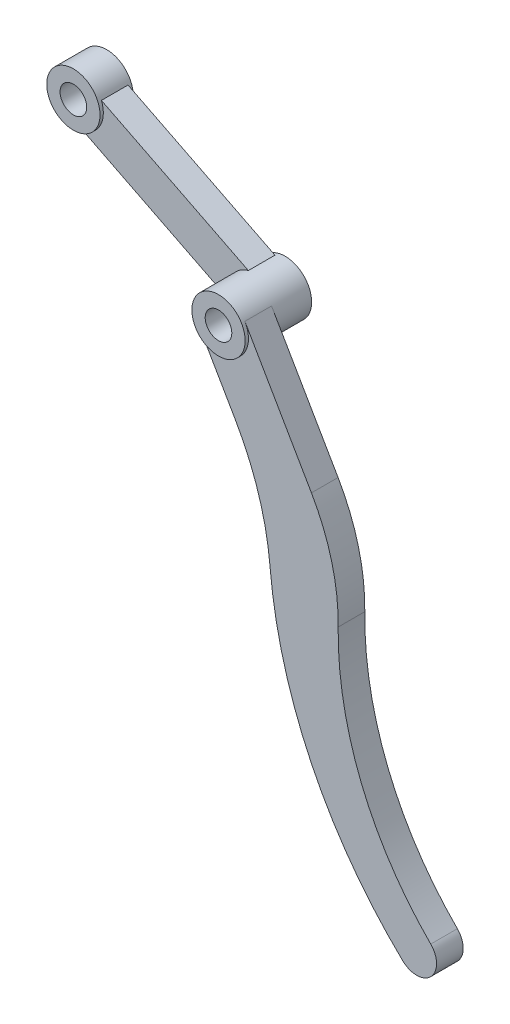
ISO-10303-21;
HEADER;
FILE_DESCRIPTION(('STEP AP214'),'2;1');
FILE_NAME('part.step','',(''),(''),'','','');
FILE_SCHEMA(('AUTOMOTIVE_DESIGN { 1 0 10303 214 1 1 1 1 }'));
ENDSEC;
DATA;
#1=APPLICATION_CONTEXT('core data for automotive mechanical design processes');
#2=APPLICATION_PROTOCOL_DEFINITION('international standard','automotive_design',2000,#1);
#3=PRODUCT_CONTEXT('',#1,'mechanical');
#4=PRODUCT('Part','Part','',(#3));
#5=PRODUCT_RELATED_PRODUCT_CATEGORY('part','',(#4));
#6=PRODUCT_DEFINITION_FORMATION('','',#4);
#7=PRODUCT_DEFINITION_CONTEXT('part definition',#1,'design');
#8=PRODUCT_DEFINITION('design','',#6,#7);
#9=PRODUCT_DEFINITION_SHAPE('','',#8);
#10=(LENGTH_UNIT() NAMED_UNIT(*) SI_UNIT(.MILLI.,.METRE.));
#11=(NAMED_UNIT(*) PLANE_ANGLE_UNIT() SI_UNIT($,.RADIAN.));
#12=(NAMED_UNIT(*) SI_UNIT($,.STERADIAN.) SOLID_ANGLE_UNIT());
#13=UNCERTAINTY_MEASURE_WITH_UNIT(LENGTH_MEASURE(1.E-05),#10,'distance_accuracy_value','');
#14=(GEOMETRIC_REPRESENTATION_CONTEXT(3) GLOBAL_UNCERTAINTY_ASSIGNED_CONTEXT((#13)) GLOBAL_UNIT_ASSIGNED_CONTEXT((#10,
#11,#12)) REPRESENTATION_CONTEXT('',''));
#15=CARTESIAN_POINT('',(0.,0.,0.));
#16=DIRECTION('',(0.,0.,1.));
#17=DIRECTION('',(1.,0.,0.));
#18=AXIS2_PLACEMENT_3D('',#15,#16,#17);
#19=CARTESIAN_POINT('',(0.,0.,-10.));
#20=DIRECTION('',(0.,0.,1.));
#21=DIRECTION('',(1.,0.,0.));
#22=AXIS2_PLACEMENT_3D('',#19,#20,#21);
#23=CYLINDRICAL_SURFACE('',#22,8.);
#24=CARTESIAN_POINT('',(0.,0.,9.));
#25=DIRECTION('',(0.,0.,-1.));
#26=DIRECTION('',(1.,0.,0.));
#27=AXIS2_PLACEMENT_3D('',#24,#25,#26);
#28=CIRCLE('',#27,8.);
#29=CARTESIAN_POINT('',(6.9282032302755,4.00000000000001,9.));
#30=VERTEX_POINT('',#29);
#31=CARTESIAN_POINT('',(-6.92820323027548,-4.00000000000006,9.));
#32=VERTEX_POINT('',#31);
#33=EDGE_CURVE('E127',#30,#32,#28,.T.);
#34=ORIENTED_EDGE('',*,*,#33,.F.);
#35=DIRECTION('',(0.,0.,-1.));
#36=VECTOR('',#35,1.);
#37=CARTESIAN_POINT('',(6.9282032302755,4.00000000000001,9.));
#38=LINE('',#37,#36);
#39=CARTESIAN_POINT('',(6.9282032302755,4.00000000000001,1.));
#40=VERTEX_POINT('',#39);
#41=EDGE_CURVE('E393',#30,#40,#38,.T.);
#42=ORIENTED_EDGE('',*,*,#41,.T.);
#43=CARTESIAN_POINT('',(0.,0.,1.));
#44=DIRECTION('',(0.,0.,-1.));
#45=DIRECTION('',(1.,0.,0.));
#46=AXIS2_PLACEMENT_3D('',#43,#44,#45);
#47=CIRCLE('',#46,8.);
#48=CARTESIAN_POINT('',(-6.92820323027548,-4.00000000000006,0.999999999999999));
#49=VERTEX_POINT('',#48);
#50=EDGE_CURVE('E141',#40,#49,#47,.T.);
#51=ORIENTED_EDGE('',*,*,#50,.T.);
#52=DIRECTION('',(0.,0.,-1.));
#53=VECTOR('',#52,1.);
#54=CARTESIAN_POINT('',(-6.92820323027548,-4.00000000000006,9.));
#55=LINE('',#54,#53);
#56=EDGE_CURVE('E47',#32,#49,#55,.T.);
#57=ORIENTED_EDGE('',*,*,#56,.F.);
#58=EDGE_LOOP('',(#34,#42,#51,#57));
#59=FACE_BOUND('',#58,.T.);
#60=CARTESIAN_POINT('',(0.,0.,-10.));
#61=DIRECTION('',(0.,0.,1.));
#62=DIRECTION('',(1.,0.,0.));
#63=AXIS2_PLACEMENT_3D('',#60,#61,#62);
#64=CIRCLE('',#63,8.);
#65=CARTESIAN_POINT('',(8.,0.,-10.));
#66=VERTEX_POINT('',#65);
#67=EDGE_CURVE('E11',#66,#66,#64,.T.);
#68=ORIENTED_EDGE('',*,*,#67,.T.);
#69=EDGE_LOOP('',(#68));
#70=FACE_BOUND('',#69,.T.);
#71=DIRECTION('',(0.,0.,1.));
#72=VECTOR('',#71,1.);
#73=CARTESIAN_POINT('',(-7.42278324041352,-2.98367038491791,-9.));
#74=LINE('',#73,#72);
#75=CARTESIAN_POINT('',(-7.42278324041352,-2.98367038491792,-9.));
#76=VERTEX_POINT('',#75);
#77=CARTESIAN_POINT('',(-7.42278324041352,-2.98367038491791,-0.999999999999999));
#78=VERTEX_POINT('',#77);
#79=EDGE_CURVE('E190',#76,#78,#74,.T.);
#80=ORIENTED_EDGE('',*,*,#79,.F.);
#81=CARTESIAN_POINT('',(0.,0.,-9.));
#82=DIRECTION('',(0.,0.,1.));
#83=DIRECTION('',(1.,0.,0.));
#84=AXIS2_PLACEMENT_3D('',#81,#82,#83);
#85=CIRCLE('',#84,8.);
#86=CARTESIAN_POINT('',(-2.03242078220373,7.73752323189187,-9.));
#87=VERTEX_POINT('',#86);
#88=EDGE_CURVE('E55',#87,#76,#85,.T.);
#89=ORIENTED_EDGE('',*,*,#88,.F.);
#90=DIRECTION('',(0.,0.,1.));
#91=VECTOR('',#90,1.);
#92=CARTESIAN_POINT('',(-2.03242078220373,7.73752323189187,-9.));
#93=LINE('',#92,#91);
#94=CARTESIAN_POINT('',(-2.03242078220373,7.73752323189187,-1.));
#95=VERTEX_POINT('',#94);
#96=EDGE_CURVE('E193',#87,#95,#93,.T.);
#97=ORIENTED_EDGE('',*,*,#96,.T.);
#98=CARTESIAN_POINT('',(0.,0.,-1.));
#99=DIRECTION('',(0.,0.,1.));
#100=DIRECTION('',(1.,0.,0.));
#101=AXIS2_PLACEMENT_3D('',#98,#99,#100);
#102=CIRCLE('',#101,8.);
#103=EDGE_CURVE('E178',#95,#78,#102,.T.);
#104=ORIENTED_EDGE('',*,*,#103,.T.);
#105=EDGE_LOOP('',(#80,#89,#97,#104));
#106=FACE_BOUND('',#105,.T.);
#107=CARTESIAN_POINT('',(0.,0.,10.));
#108=DIRECTION('',(0.,0.,1.));
#109=DIRECTION('',(1.,0.,0.));
#110=AXIS2_PLACEMENT_3D('',#107,#108,#109);
#111=CIRCLE('',#110,8.);
#112=CARTESIAN_POINT('',(8.,0.,10.));
#113=VERTEX_POINT('',#112);
#114=EDGE_CURVE('E145',#113,#113,#111,.T.);
#115=ORIENTED_EDGE('',*,*,#114,.F.);
#116=EDGE_LOOP('',(#115));
#117=FACE_BOUND('',#116,.T.);
#118=ADVANCED_FACE('F33',(#59,#70,#106,#117),#23,.T.);
#119=CARTESIAN_POINT('',(0.,0.,-10.));
#120=DIRECTION('',(0.,0.,1.));
#121=DIRECTION('',(1.,0.,0.));
#122=AXIS2_PLACEMENT_3D('',#119,#120,#121);
#123=PLANE('',#122);
#124=CARTESIAN_POINT('',(0.,0.,-10.));
#125=DIRECTION('',(0.,0.,1.));
#126=DIRECTION('',(1.,0.,0.));
#127=AXIS2_PLACEMENT_3D('',#124,#125,#126);
#128=CIRCLE('',#127,4.);
#129=CARTESIAN_POINT('',(4.,0.,-10.));
#130=VERTEX_POINT('',#129);
#131=EDGE_CURVE('E40',#130,#130,#128,.T.);
#132=ORIENTED_EDGE('',*,*,#131,.T.);
#133=EDGE_LOOP('',(#132));
#134=FACE_BOUND('',#133,.T.);
#135=ORIENTED_EDGE('',*,*,#67,.F.);
#136=EDGE_LOOP('',(#135));
#137=FACE_BOUND('',#136,.T.);
#138=ADVANCED_FACE('F197',(#134,#137),#123,.F.);
#139=CARTESIAN_POINT('',(0.,0.,-10.));
#140=DIRECTION('',(0.,0.,1.));
#141=DIRECTION('',(1.,0.,0.));
#142=AXIS2_PLACEMENT_3D('',#139,#140,#141);
#143=CYLINDRICAL_SURFACE('',#142,4.);
#144=ORIENTED_EDGE('',*,*,#131,.F.);
#145=EDGE_LOOP('',(#144));
#146=FACE_BOUND('',#145,.T.);
#147=CARTESIAN_POINT('',(0.,0.,10.));
#148=DIRECTION('',(0.,0.,1.));
#149=DIRECTION('',(1.,0.,0.));
#150=AXIS2_PLACEMENT_3D('',#147,#148,#149);
#151=CIRCLE('',#150,4.);
#152=CARTESIAN_POINT('',(4.,0.,10.));
#153=VERTEX_POINT('',#152);
#154=EDGE_CURVE('E142',#153,#153,#151,.T.);
#155=ORIENTED_EDGE('',*,*,#154,.T.);
#156=EDGE_LOOP('',(#155));
#157=FACE_BOUND('',#156,.T.);
#158=ADVANCED_FACE('F200',(#146,#157),#143,.F.);
#159=CARTESIAN_POINT('',(-46.1831848436354,29.9354826759668,-9.));
#160=DIRECTION('',(-0.449196871517481,-0.893432801400815,0.));
#161=DIRECTION('',(0.893432801400815,-0.449196871517481,0.));
#162=AXIS2_PLACEMENT_3D('',#159,#160,#161);
#163=PLANE('',#162);
#164=DIRECTION('',(0.893432801400815,-0.449196871517481,0.));
#165=VECTOR('',#164,1.);
#166=CARTESIAN_POINT('',(-46.1831848436354,29.9354826759668,-1.));
#167=LINE('',#166,#165);
#168=CARTESIAN_POINT('',(-46.1831848436354,29.9354826759668,-0.999999999999999));
#169=VERTEX_POINT('',#168);
#170=EDGE_CURVE('E163',#169,#95,#167,.T.);
#171=ORIENTED_EDGE('',*,*,#170,.T.);
#172=ORIENTED_EDGE('',*,*,#96,.F.);
#173=DIRECTION('',(0.893432801400815,-0.449196871517481,0.));
#174=VECTOR('',#173,1.);
#175=CARTESIAN_POINT('',(-46.1831848436354,29.9354826759668,-9.));
#176=LINE('',#175,#174);
#177=CARTESIAN_POINT('',(-46.1831848436354,29.9354826759668,-9.));
#178=VERTEX_POINT('',#177);
#179=EDGE_CURVE('E166',#178,#87,#176,.T.);
#180=ORIENTED_EDGE('',*,*,#179,.F.);
#181=DIRECTION('',(0.,0.,1.));
#182=VECTOR('',#181,1.);
#183=CARTESIAN_POINT('',(-46.1831848436354,29.9354826759668,-9.));
#184=LINE('',#183,#182);
#185=EDGE_CURVE('E175',#178,#169,#184,.T.);
#186=ORIENTED_EDGE('',*,*,#185,.T.);
#187=EDGE_LOOP('',(#171,#172,#180,#186));
#188=FACE_BOUND('',#187,.T.);
#189=ADVANCED_FACE('F203',(#188),#163,.F.);
#190=CARTESIAN_POINT('',(-51.5735473018452,19.214289059157,-9.));
#191=DIRECTION('',(-0.449196871517481,-0.893432801400815,0.));
#192=DIRECTION('',(0.893432801400815,-0.449196871517481,0.));
#193=AXIS2_PLACEMENT_3D('',#190,#191,#192);
#194=PLANE('',#193);
#195=DIRECTION('',(0.893432801400815,-0.449196871517481,0.));
#196=VECTOR('',#195,1.);
#197=CARTESIAN_POINT('',(-51.5735473018452,19.214289059157,-1.));
#198=LINE('',#197,#196);
#199=CARTESIAN_POINT('',(-51.5735473018452,19.214289059157,-1.));
#200=VERTEX_POINT('',#199);
#201=EDGE_CURVE('E180',#200,#78,#198,.T.);
#202=ORIENTED_EDGE('',*,*,#201,.F.);
#203=DIRECTION('',(0.,0.,1.));
#204=VECTOR('',#203,1.);
#205=CARTESIAN_POINT('',(-51.5735473018452,19.214289059157,-9.));
#206=LINE('',#205,#204);
#207=CARTESIAN_POINT('',(-51.5735473018452,19.214289059157,-9.));
#208=VERTEX_POINT('',#207);
#209=EDGE_CURVE('E187',#208,#200,#206,.T.);
#210=ORIENTED_EDGE('',*,*,#209,.F.);
#211=DIRECTION('',(0.893432801400815,-0.449196871517481,0.));
#212=VECTOR('',#211,1.);
#213=CARTESIAN_POINT('',(-51.5735473018452,19.214289059157,-9.));
#214=LINE('',#213,#212);
#215=EDGE_CURVE('E170',#208,#76,#214,.T.);
#216=ORIENTED_EDGE('',*,*,#215,.T.);
#217=ORIENTED_EDGE('',*,*,#79,.T.);
#218=EDGE_LOOP('',(#202,#210,#216,#217));
#219=FACE_BOUND('',#218,.T.);
#220=ADVANCED_FACE('F230',(#219),#194,.T.);
#221=CARTESIAN_POINT('',(0.,0.,-9.));
#222=DIRECTION('',(0.,0.,1.));
#223=DIRECTION('',(1.,0.,0.));
#224=AXIS2_PLACEMENT_3D('',#221,#222,#223);
#225=PLANE('',#224);
#226=ORIENTED_EDGE('',*,*,#179,.T.);
#227=ORIENTED_EDGE('',*,*,#88,.T.);
#228=ORIENTED_EDGE('',*,*,#215,.F.);
#229=CARTESIAN_POINT('',(-53.6059680840489,26.9518122910489,-9.));
#230=DIRECTION('',(0.,0.,1.));
#231=DIRECTION('',(1.,0.,0.));
#232=AXIS2_PLACEMENT_3D('',#229,#230,#231);
#233=CIRCLE('',#232,8.);
#234=EDGE_CURVE('E173',#208,#178,#233,.T.);
#235=ORIENTED_EDGE('',*,*,#234,.T.);
#236=EDGE_LOOP('',(#226,#227,#228,#235));
#237=FACE_BOUND('',#236,.T.);
#238=ADVANCED_FACE('F234',(#237),#225,.F.);
#239=CARTESIAN_POINT('',(0.,0.,-1.));
#240=DIRECTION('',(0.,0.,1.));
#241=DIRECTION('',(1.,0.,0.));
#242=AXIS2_PLACEMENT_3D('',#239,#240,#241);
#243=PLANE('',#242);
#244=ORIENTED_EDGE('',*,*,#170,.F.);
#245=CARTESIAN_POINT('',(-53.6059680840489,26.9518122910489,-1.));
#246=DIRECTION('',(0.,0.,1.));
#247=DIRECTION('',(1.,0.,0.));
#248=AXIS2_PLACEMENT_3D('',#245,#246,#247);
#249=CIRCLE('',#248,8.);
#250=EDGE_CURVE('E168',#200,#169,#249,.T.);
#251=ORIENTED_EDGE('',*,*,#250,.F.);
#252=ORIENTED_EDGE('',*,*,#201,.T.);
#253=ORIENTED_EDGE('',*,*,#103,.F.);
#254=EDGE_LOOP('',(#244,#251,#252,#253));
#255=FACE_BOUND('',#254,.T.);
#256=ADVANCED_FACE('F236',(#255),#243,.T.);
#257=CARTESIAN_POINT('',(-53.6059680840489,26.9518122910489,-10.));
#258=DIRECTION('',(0.,0.,1.));
#259=DIRECTION('',(1.,0.,0.));
#260=AXIS2_PLACEMENT_3D('',#257,#258,#259);
#261=CYLINDRICAL_SURFACE('',#260,8.);
#262=CARTESIAN_POINT('',(-53.6059680840489,26.9518122910489,0.));
#263=DIRECTION('',(0.,0.,1.));
#264=DIRECTION('',(1.,0.,0.));
#265=AXIS2_PLACEMENT_3D('',#262,#263,#264);
#266=CIRCLE('',#265,8.);
#267=CARTESIAN_POINT('',(-45.6059680840489,26.9518122910489,0.));
#268=VERTEX_POINT('',#267);
#269=EDGE_CURVE('E157',#268,#268,#266,.T.);
#270=ORIENTED_EDGE('',*,*,#269,.F.);
#271=EDGE_LOOP('',(#270));
#272=FACE_BOUND('',#271,.T.);
#273=CARTESIAN_POINT('',(-53.6059680840489,26.9518122910489,-10.));
#274=DIRECTION('',(0.,0.,1.));
#275=DIRECTION('',(1.,0.,0.));
#276=AXIS2_PLACEMENT_3D('',#273,#274,#275);
#277=CIRCLE('',#276,8.);
#278=CARTESIAN_POINT('',(-45.6059680840489,26.9518122910489,-10.));
#279=VERTEX_POINT('',#278);
#280=EDGE_CURVE('E160',#279,#279,#277,.T.);
#281=ORIENTED_EDGE('',*,*,#280,.T.);
#282=EDGE_LOOP('',(#281));
#283=FACE_BOUND('',#282,.T.);
#284=ORIENTED_EDGE('',*,*,#234,.F.);
#285=ORIENTED_EDGE('',*,*,#209,.T.);
#286=ORIENTED_EDGE('',*,*,#250,.T.);
#287=ORIENTED_EDGE('',*,*,#185,.F.);
#288=EDGE_LOOP('',(#284,#285,#286,#287));
#289=FACE_BOUND('',#288,.T.);
#290=ADVANCED_FACE('F239',(#272,#283,#289),#261,.T.);
#291=CARTESIAN_POINT('',(-53.6059680840489,26.9518122910489,-10.));
#292=DIRECTION('',(0.,0.,1.));
#293=DIRECTION('',(1.,0.,0.));
#294=AXIS2_PLACEMENT_3D('',#291,#292,#293);
#295=PLANE('',#294);
#296=CARTESIAN_POINT('',(-53.6059680840489,26.9518122910489,-10.));
#297=DIRECTION('',(0.,0.,1.));
#298=DIRECTION('',(1.,0.,0.));
#299=AXIS2_PLACEMENT_3D('',#296,#297,#298);
#300=CIRCLE('',#299,4.);
#301=CARTESIAN_POINT('',(-49.6059680840489,26.9518122910489,-10.));
#302=VERTEX_POINT('',#301);
#303=EDGE_CURVE('E154',#302,#302,#300,.T.);
#304=ORIENTED_EDGE('',*,*,#303,.T.);
#305=EDGE_LOOP('',(#304));
#306=FACE_BOUND('',#305,.T.);
#307=ORIENTED_EDGE('',*,*,#280,.F.);
#308=EDGE_LOOP('',(#307));
#309=FACE_BOUND('',#308,.T.);
#310=ADVANCED_FACE('F246',(#306,#309),#295,.F.);
#311=CARTESIAN_POINT('',(-53.6059680840489,26.9518122910489,0.));
#312=DIRECTION('',(0.,0.,1.));
#313=DIRECTION('',(1.,0.,0.));
#314=AXIS2_PLACEMENT_3D('',#311,#312,#313);
#315=PLANE('',#314);
#316=CARTESIAN_POINT('',(-53.6059680840489,26.9518122910489,0.));
#317=DIRECTION('',(0.,0.,1.));
#318=DIRECTION('',(1.,0.,0.));
#319=AXIS2_PLACEMENT_3D('',#316,#317,#318);
#320=CIRCLE('',#319,4.);
#321=CARTESIAN_POINT('',(-49.6059680840489,26.9518122910489,0.));
#322=VERTEX_POINT('',#321);
#323=EDGE_CURVE('E153',#322,#322,#320,.T.);
#324=ORIENTED_EDGE('',*,*,#323,.F.);
#325=EDGE_LOOP('',(#324));
#326=FACE_BOUND('',#325,.T.);
#327=ORIENTED_EDGE('',*,*,#269,.T.);
#328=EDGE_LOOP('',(#327));
#329=FACE_BOUND('',#328,.T.);
#330=ADVANCED_FACE('F218',(#326,#329),#315,.T.);
#331=CARTESIAN_POINT('',(-53.6059680840489,26.9518122910489,-10.));
#332=DIRECTION('',(0.,0.,1.));
#333=DIRECTION('',(1.,0.,0.));
#334=AXIS2_PLACEMENT_3D('',#331,#332,#333);
#335=CYLINDRICAL_SURFACE('',#334,4.);
#336=ORIENTED_EDGE('',*,*,#303,.F.);
#337=EDGE_LOOP('',(#336));
#338=FACE_BOUND('',#337,.T.);
#339=ORIENTED_EDGE('',*,*,#323,.T.);
#340=EDGE_LOOP('',(#339));
#341=FACE_BOUND('',#340,.T.);
#342=ADVANCED_FACE('F209',(#338,#341),#335,.F.);
#343=CARTESIAN_POINT('',(0.,0.,10.));
#344=DIRECTION('',(0.,0.,1.));
#345=DIRECTION('',(1.,0.,0.));
#346=AXIS2_PLACEMENT_3D('',#343,#344,#345);
#347=PLANE('',#346);
#348=ORIENTED_EDGE('',*,*,#114,.T.);
#349=EDGE_LOOP('',(#348));
#350=FACE_BOUND('',#349,.T.);
#351=ORIENTED_EDGE('',*,*,#154,.F.);
#352=EDGE_LOOP('',(#351));
#353=FACE_BOUND('',#352,.T.);
#354=ADVANCED_FACE('F207',(#350,#353),#347,.T.);
#355=CARTESIAN_POINT('',(-6.92820323027548,-4.00000000000006,9.));
#356=DIRECTION('',(0.866025403784438,0.500000000000001,0.));
#357=DIRECTION('',(-0.500000000000001,0.866025403784438,0.));
#358=AXIS2_PLACEMENT_3D('',#355,#356,#357);
#359=PLANE('',#358);
#360=DIRECTION('',(0.500000000000001,-0.866025403784438,0.));
#361=VECTOR('',#360,1.);
#362=CARTESIAN_POINT('',(-6.92820323027548,-4.00000000000006,1.));
#363=LINE('',#362,#361);
#364=CARTESIAN_POINT('',(4.07179676972455,-23.0525588832577,1.));
#365=VERTEX_POINT('',#364);
#366=EDGE_CURVE('E391',#49,#365,#363,.T.);
#367=ORIENTED_EDGE('',*,*,#366,.T.);
#368=DIRECTION('',(0.,0.,-1.));
#369=VECTOR('',#368,1.);
#370=CARTESIAN_POINT('',(4.07179676972455,-23.0525588832577,9.));
#371=LINE('',#370,#369);
#372=CARTESIAN_POINT('',(4.07179676972455,-23.0525588832577,9.));
#373=VERTEX_POINT('',#372);
#374=EDGE_CURVE('E123',#373,#365,#371,.T.);
#375=ORIENTED_EDGE('',*,*,#374,.F.);
#376=DIRECTION('',(0.500000000000001,-0.866025403784438,0.));
#377=VECTOR('',#376,1.);
#378=CARTESIAN_POINT('',(-6.92820323027548,-4.00000000000006,9.));
#379=LINE('',#378,#377);
#380=EDGE_CURVE('E119',#32,#373,#379,.T.);
#381=ORIENTED_EDGE('',*,*,#380,.F.);
#382=ORIENTED_EDGE('',*,*,#56,.T.);
#383=EDGE_LOOP('',(#367,#375,#381,#382));
#384=FACE_BOUND('',#383,.T.);
#385=ADVANCED_FACE('F121',(#384),#359,.F.);
#386=CARTESIAN_POINT('',(-65.2102355330305,-63.0525588832578,9.));
#387=DIRECTION('',(0.,0.,-1.));
#388=DIRECTION('',(-1.,0.,0.));
#389=AXIS2_PLACEMENT_3D('',#386,#387,#388);
#390=CYLINDRICAL_SURFACE('',#389,80.);
#391=CARTESIAN_POINT('',(-65.2102355330305,-63.0525588832578,1.));
#392=DIRECTION('',(0.,0.,-1.));
#393=DIRECTION('',(-1.,0.,0.));
#394=AXIS2_PLACEMENT_3D('',#391,#392,#393);
#395=CIRCLE('',#394,80.);
#396=CARTESIAN_POINT('',(14.4772826467712,-55.988604867002,1.));
#397=VERTEX_POINT('',#396);
#398=EDGE_CURVE('E419',#365,#397,#395,.T.);
#399=ORIENTED_EDGE('',*,*,#398,.T.);
#400=DIRECTION('',(0.,0.,-1.));
#401=VECTOR('',#400,1.);
#402=CARTESIAN_POINT('',(14.4772826467712,-55.988604867002,9.));
#403=LINE('',#402,#401);
#404=CARTESIAN_POINT('',(14.4772826467712,-55.988604867002,9.));
#405=VERTEX_POINT('',#404);
#406=EDGE_CURVE('E147',#405,#397,#403,.T.);
#407=ORIENTED_EDGE('',*,*,#406,.F.);
#408=CARTESIAN_POINT('',(-65.2102355330305,-63.0525588832578,9.));
#409=DIRECTION('',(0.,0.,-1.));
#410=DIRECTION('',(-1.,0.,0.));
#411=AXIS2_PLACEMENT_3D('',#408,#409,#410);
#412=CIRCLE('',#411,80.);
#413=EDGE_CURVE('E126',#373,#405,#412,.T.);
#414=ORIENTED_EDGE('',*,*,#413,.F.);
#415=ORIENTED_EDGE('',*,*,#374,.T.);
#416=EDGE_LOOP('',(#399,#407,#414,#415));
#417=FACE_BOUND('',#416,.T.);
#418=ADVANCED_FACE('F216',(#417),#390,.F.);
#419=CARTESIAN_POINT('',(143.969499688949,-44.5096795905865,9.));
#420=DIRECTION('',(0.,0.,-1.));
#421=DIRECTION('',(-1.,0.,0.));
#422=AXIS2_PLACEMENT_3D('',#419,#420,#421);
#423=CYLINDRICAL_SURFACE('',#422,130.);
#424=CARTESIAN_POINT('',(143.969499688949,-44.5096795905865,1.));
#425=DIRECTION('',(0.,0.,1.));
#426=DIRECTION('',(1.,0.,0.));
#427=AXIS2_PLACEMENT_3D('',#424,#425,#426);
#428=CIRCLE('',#427,130.);
#429=CARTESIAN_POINT('',(54.3974443559804,-138.726699833362,1.));
#430=VERTEX_POINT('',#429);
#431=EDGE_CURVE('E416',#397,#430,#428,.T.);
#432=ORIENTED_EDGE('',*,*,#431,.T.);
#433=DIRECTION('',(0.,0.,-1.));
#434=VECTOR('',#433,1.);
#435=CARTESIAN_POINT('',(54.3974443559804,-138.726699833362,9.));
#436=LINE('',#435,#434);
#437=CARTESIAN_POINT('',(54.3974443559804,-138.726699833362,9.));
#438=VERTEX_POINT('',#437);
#439=EDGE_CURVE('E409',#438,#430,#436,.T.);
#440=ORIENTED_EDGE('',*,*,#439,.F.);
#441=CARTESIAN_POINT('',(143.969499688949,-44.5096795905865,9.));
#442=DIRECTION('',(0.,0.,1.));
#443=DIRECTION('',(1.,0.,0.));
#444=AXIS2_PLACEMENT_3D('',#441,#442,#443);
#445=CIRCLE('',#444,130.);
#446=EDGE_CURVE('E417',#405,#438,#445,.T.);
#447=ORIENTED_EDGE('',*,*,#446,.F.);
#448=ORIENTED_EDGE('',*,*,#406,.T.);
#449=EDGE_LOOP('',(#432,#440,#447,#448));
#450=FACE_BOUND('',#449,.T.);
#451=ADVANCED_FACE('F317',(#450),#423,.T.);
#452=CARTESIAN_POINT('',(58.5315392175021,-134.378221976003,9.));
#453=DIRECTION('',(0.,0.,-1.));
#454=DIRECTION('',(-1.,0.,0.));
#455=AXIS2_PLACEMENT_3D('',#452,#453,#454);
#456=CYLINDRICAL_SURFACE('',#455,6.00000000000001);
#457=CARTESIAN_POINT('',(58.5315392175021,-134.378221976003,1.));
#458=DIRECTION('',(0.,0.,1.));
#459=DIRECTION('',(1.,0.,0.));
#460=AXIS2_PLACEMENT_3D('',#457,#458,#459);
#461=CIRCLE('',#460,6.00000000000001);
#462=CARTESIAN_POINT('',(62.7741799046214,-130.135581288884,1.));
#463=VERTEX_POINT('',#462);
#464=EDGE_CURVE('E421',#430,#463,#461,.T.);
#465=ORIENTED_EDGE('',*,*,#464,.T.);
#466=DIRECTION('',(0.,0.,-1.));
#467=VECTOR('',#466,1.);
#468=CARTESIAN_POINT('',(62.7741799046214,-130.135581288884,9.));
#469=LINE('',#468,#467);
#470=CARTESIAN_POINT('',(62.7741799046214,-130.135581288884,9.));
#471=VERTEX_POINT('',#470);
#472=EDGE_CURVE('E406',#471,#463,#469,.T.);
#473=ORIENTED_EDGE('',*,*,#472,.F.);
#474=CARTESIAN_POINT('',(58.5315392175021,-134.378221976003,9.));
#475=DIRECTION('',(0.,0.,1.));
#476=DIRECTION('',(1.,0.,0.));
#477=AXIS2_PLACEMENT_3D('',#474,#475,#476);
#478=CIRCLE('',#477,6.00000000000001);
#479=EDGE_CURVE('E434',#438,#471,#478,.T.);
#480=ORIENTED_EDGE('',*,*,#479,.F.);
#481=ORIENTED_EDGE('',*,*,#439,.T.);
#482=EDGE_LOOP('',(#465,#473,#480,#481));
#483=FACE_BOUND('',#482,.T.);
#484=ADVANCED_FACE('F327',(#483),#456,.T.);
#485=CARTESIAN_POINT('',(129.949324117344,-62.9604370761623,9.));
#486=DIRECTION('',(0.,0.,-1.));
#487=DIRECTION('',(-1.,0.,0.));
#488=AXIS2_PLACEMENT_3D('',#485,#486,#487);
#489=CYLINDRICAL_SURFACE('',#488,95.);
#490=CARTESIAN_POINT('',(129.949324117344,-62.9604370761623,1.));
#491=DIRECTION('',(0.,0.,-1.));
#492=DIRECTION('',(-1.,0.,0.));
#493=AXIS2_PLACEMENT_3D('',#490,#491,#492);
#494=CIRCLE('',#493,95.);
#495=CARTESIAN_POINT('',(34.9599609828741,-61.5388565093587,1.));
#496=VERTEX_POINT('',#495);
#497=EDGE_CURVE('E423',#463,#496,#494,.T.);
#498=ORIENTED_EDGE('',*,*,#497,.T.);
#499=DIRECTION('',(0.,0.,-1.));
#500=VECTOR('',#499,1.);
#501=CARTESIAN_POINT('',(34.9599609828741,-61.5388565093587,9.));
#502=LINE('',#501,#500);
#503=CARTESIAN_POINT('',(34.9599609828741,-61.5388565093587,9.));
#504=VERTEX_POINT('',#503);
#505=EDGE_CURVE('E397',#504,#496,#502,.T.);
#506=ORIENTED_EDGE('',*,*,#505,.F.);
#507=CARTESIAN_POINT('',(129.949324117344,-62.9604370761623,9.));
#508=DIRECTION('',(0.,0.,-1.));
#509=DIRECTION('',(-1.,0.,0.));
#510=AXIS2_PLACEMENT_3D('',#507,#508,#509);
#511=CIRCLE('',#510,95.);
#512=EDGE_CURVE('E432',#471,#504,#511,.T.);
#513=ORIENTED_EDGE('',*,*,#512,.F.);
#514=ORIENTED_EDGE('',*,*,#472,.T.);
#515=EDGE_LOOP('',(#498,#506,#513,#514));
#516=FACE_BOUND('',#515,.T.);
#517=ADVANCED_FACE('F337',(#516),#489,.F.);
#518=CARTESIAN_POINT('',(-25.0333209967907,-60.6410161513776,9.));
#519=DIRECTION('',(0.,0.,-1.));
#520=DIRECTION('',(-1.,0.,0.));
#521=AXIS2_PLACEMENT_3D('',#518,#519,#520);
#522=CYLINDRICAL_SURFACE('',#521,60.);
#523=CARTESIAN_POINT('',(-25.0333209967907,-60.6410161513776,1.));
#524=DIRECTION('',(0.,0.,1.));
#525=DIRECTION('',(1.,0.,0.));
#526=AXIS2_PLACEMENT_3D('',#523,#524,#525);
#527=CIRCLE('',#526,60.);
#528=CARTESIAN_POINT('',(26.9282032302756,-30.6410161513775,1.));
#529=VERTEX_POINT('',#528);
#530=EDGE_CURVE('E428',#496,#529,#527,.T.);
#531=ORIENTED_EDGE('',*,*,#530,.T.);
#532=DIRECTION('',(0.,0.,-1.));
#533=VECTOR('',#532,1.);
#534=CARTESIAN_POINT('',(26.9282032302756,-30.6410161513775,9.));
#535=LINE('',#534,#533);
#536=CARTESIAN_POINT('',(26.9282032302756,-30.6410161513775,9.));
#537=VERTEX_POINT('',#536);
#538=EDGE_CURVE('E394',#537,#529,#535,.T.);
#539=ORIENTED_EDGE('',*,*,#538,.F.);
#540=CARTESIAN_POINT('',(-25.0333209967907,-60.6410161513776,9.));
#541=DIRECTION('',(0.,0.,1.));
#542=DIRECTION('',(1.,0.,0.));
#543=AXIS2_PLACEMENT_3D('',#540,#541,#542);
#544=CIRCLE('',#543,60.);
#545=EDGE_CURVE('E399',#504,#537,#544,.T.);
#546=ORIENTED_EDGE('',*,*,#545,.F.);
#547=ORIENTED_EDGE('',*,*,#505,.T.);
#548=EDGE_LOOP('',(#531,#539,#546,#547));
#549=FACE_BOUND('',#548,.T.);
#550=ADVANCED_FACE('F347',(#549),#522,.T.);
#551=CARTESIAN_POINT('',(6.9282032302755,4.00000000000001,9.));
#552=DIRECTION('',(-0.866025403784438,-0.500000000000001,0.));
#553=DIRECTION('',(0.500000000000001,-0.866025403784438,0.));
#554=AXIS2_PLACEMENT_3D('',#551,#552,#553);
#555=PLANE('',#554);
#556=DIRECTION('',(-0.500000000000001,0.866025403784438,0.));
#557=VECTOR('',#556,1.);
#558=CARTESIAN_POINT('',(6.9282032302755,4.00000000000001,1.));
#559=LINE('',#558,#557);
#560=EDGE_CURVE('E136',#529,#40,#559,.T.);
#561=ORIENTED_EDGE('',*,*,#560,.T.);
#562=ORIENTED_EDGE('',*,*,#41,.F.);
#563=DIRECTION('',(-0.500000000000001,0.866025403784438,0.));
#564=VECTOR('',#563,1.);
#565=CARTESIAN_POINT('',(6.9282032302755,4.00000000000001,9.));
#566=LINE('',#565,#564);
#567=EDGE_CURVE('E132',#537,#30,#566,.T.);
#568=ORIENTED_EDGE('',*,*,#567,.F.);
#569=ORIENTED_EDGE('',*,*,#538,.T.);
#570=EDGE_LOOP('',(#561,#562,#568,#569));
#571=FACE_BOUND('',#570,.T.);
#572=ADVANCED_FACE('F357',(#571),#555,.F.);
#573=CARTESIAN_POINT('',(0.,0.,9.));
#574=DIRECTION('',(0.,0.,1.));
#575=DIRECTION('',(1.,0.,0.));
#576=AXIS2_PLACEMENT_3D('',#573,#574,#575);
#577=PLANE('',#576);
#578=ORIENTED_EDGE('',*,*,#33,.T.);
#579=ORIENTED_EDGE('',*,*,#380,.T.);
#580=ORIENTED_EDGE('',*,*,#413,.T.);
#581=ORIENTED_EDGE('',*,*,#446,.T.);
#582=ORIENTED_EDGE('',*,*,#479,.T.);
#583=ORIENTED_EDGE('',*,*,#512,.T.);
#584=ORIENTED_EDGE('',*,*,#545,.T.);
#585=ORIENTED_EDGE('',*,*,#567,.T.);
#586=EDGE_LOOP('',(#578,#579,#580,#581,#582,#583,#584,#585));
#587=FACE_BOUND('',#586,.T.);
#588=ADVANCED_FACE('F130',(#587),#577,.T.);
#589=CARTESIAN_POINT('',(0.,0.,1.));
#590=DIRECTION('',(0.,0.,1.));
#591=DIRECTION('',(1.,0.,0.));
#592=AXIS2_PLACEMENT_3D('',#589,#590,#591);
#593=PLANE('',#592);
#594=ORIENTED_EDGE('',*,*,#50,.F.);
#595=ORIENTED_EDGE('',*,*,#560,.F.);
#596=ORIENTED_EDGE('',*,*,#530,.F.);
#597=ORIENTED_EDGE('',*,*,#497,.F.);
#598=ORIENTED_EDGE('',*,*,#464,.F.);
#599=ORIENTED_EDGE('',*,*,#431,.F.);
#600=ORIENTED_EDGE('',*,*,#398,.F.);
#601=ORIENTED_EDGE('',*,*,#366,.F.);
#602=EDGE_LOOP('',(#594,#595,#596,#597,#598,#599,#600,#601));
#603=FACE_BOUND('',#602,.T.);
#604=ADVANCED_FACE('F376',(#603),#593,.F.);
#605=CLOSED_SHELL('',(#118,#138,#158,#189,#220,#238,#256,#290,#310,#330,#342,#354,#385,#418,
#451,#484,#517,#550,#572,#588,#604));
#606=MANIFOLD_SOLID_BREP('B2',#605);
#607=ADVANCED_BREP_SHAPE_REPRESENTATION('',(#18,#606),#14);
#608=SHAPE_DEFINITION_REPRESENTATION(#9,#607);
ENDSEC;
END-ISO-10303-21;
